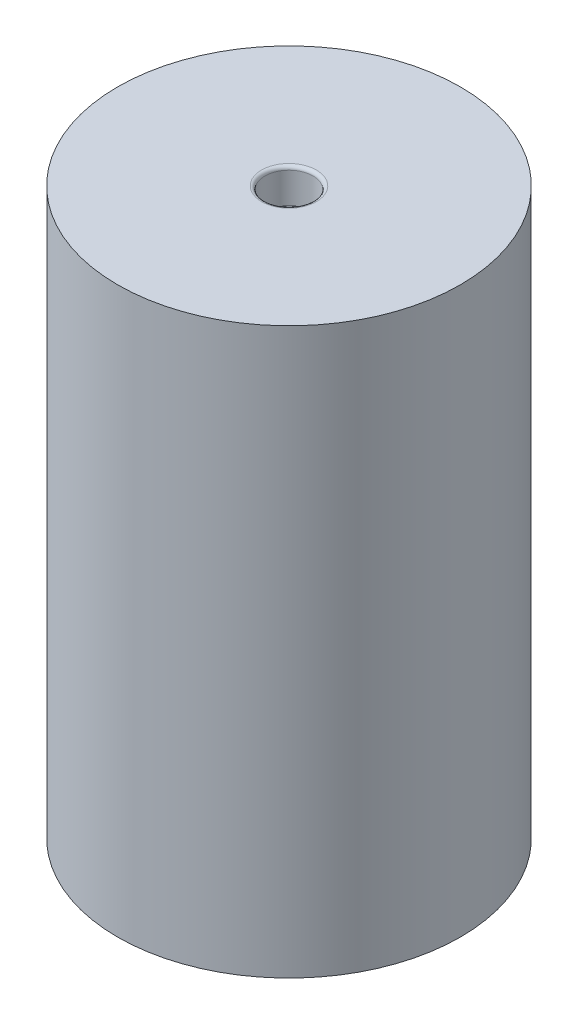
ISO-10303-21;
HEADER;
FILE_DESCRIPTION(('STEP AP214'),'2;1');
FILE_NAME('part.step','',(''),(''),'','','');
FILE_SCHEMA(('AUTOMOTIVE_DESIGN { 1 0 10303 214 1 1 1 1 }'));
ENDSEC;
DATA;
#1=APPLICATION_CONTEXT('core data for automotive mechanical design processes');
#2=APPLICATION_PROTOCOL_DEFINITION('international standard','automotive_design',2000,#1);
#3=PRODUCT_CONTEXT('',#1,'mechanical');
#4=PRODUCT('Part','Part','',(#3));
#5=PRODUCT_RELATED_PRODUCT_CATEGORY('part','',(#4));
#6=PRODUCT_DEFINITION_FORMATION('','',#4);
#7=PRODUCT_DEFINITION_CONTEXT('part definition',#1,'design');
#8=PRODUCT_DEFINITION('design','',#6,#7);
#9=PRODUCT_DEFINITION_SHAPE('','',#8);
#10=(LENGTH_UNIT() NAMED_UNIT(*) SI_UNIT(.MILLI.,.METRE.));
#11=(NAMED_UNIT(*) PLANE_ANGLE_UNIT() SI_UNIT($,.RADIAN.));
#12=(NAMED_UNIT(*) SI_UNIT($,.STERADIAN.) SOLID_ANGLE_UNIT());
#13=UNCERTAINTY_MEASURE_WITH_UNIT(LENGTH_MEASURE(1.E-05),#10,'distance_accuracy_value','');
#14=(GEOMETRIC_REPRESENTATION_CONTEXT(3) GLOBAL_UNCERTAINTY_ASSIGNED_CONTEXT((#13)) GLOBAL_UNIT_ASSIGNED_CONTEXT((#10,
#11,#12)) REPRESENTATION_CONTEXT('',''));
#15=CARTESIAN_POINT('',(0.,0.,0.));
#16=DIRECTION('',(0.,0.,1.));
#17=DIRECTION('',(1.,0.,0.));
#18=AXIS2_PLACEMENT_3D('',#15,#16,#17);
#19=CARTESIAN_POINT('',(0.,82.4,0.));
#20=DIRECTION('',(0.,-1.,0.));
#21=DIRECTION('',(0.,0.,-1.));
#22=AXIS2_PLACEMENT_3D('',#19,#20,#21);
#23=CYLINDRICAL_SURFACE('',#22,25.);
#24=CARTESIAN_POINT('',(0.,82.4,0.));
#25=DIRECTION('',(0.,1.,0.));
#26=DIRECTION('',(0.,0.,1.));
#27=AXIS2_PLACEMENT_3D('',#24,#25,#26);
#28=CIRCLE('',#27,25.);
#29=CARTESIAN_POINT('',(0.,82.4,25.));
#30=VERTEX_POINT('',#29);
#31=EDGE_CURVE('E55',#30,#30,#28,.T.);
#32=ORIENTED_EDGE('',*,*,#31,.F.);
#33=EDGE_LOOP('',(#32));
#34=FACE_BOUND('',#33,.T.);
#35=CARTESIAN_POINT('',(0.,0.,0.));
#36=DIRECTION('',(0.,1.,0.));
#37=DIRECTION('',(0.,0.,1.));
#38=AXIS2_PLACEMENT_3D('',#35,#36,#37);
#39=CIRCLE('',#38,25.);
#40=CARTESIAN_POINT('',(0.,0.,25.));
#41=VERTEX_POINT('',#40);
#42=EDGE_CURVE('E56',#41,#41,#39,.T.);
#43=ORIENTED_EDGE('',*,*,#42,.T.);
#44=EDGE_LOOP('',(#43));
#45=FACE_BOUND('',#44,.T.);
#46=ADVANCED_FACE('F35',(#34,#45),#23,.T.);
#47=CARTESIAN_POINT('',(0.,82.4,0.));
#48=DIRECTION('',(0.,1.,0.));
#49=DIRECTION('',(0.,0.,1.));
#50=AXIS2_PLACEMENT_3D('',#47,#48,#49);
#51=PLANE('',#50);
#52=CARTESIAN_POINT('',(0.,82.4,0.));
#53=DIRECTION('',(0.,1.,0.));
#54=DIRECTION('',(0.,0.,1.));
#55=AXIS2_PLACEMENT_3D('',#52,#53,#54);
#56=CIRCLE('',#55,4.);
#57=CARTESIAN_POINT('',(0.,82.4,4.));
#58=VERTEX_POINT('',#57);
#59=EDGE_CURVE('E46',#58,#58,#56,.F.);
#60=ORIENTED_EDGE('',*,*,#59,.T.);
#61=EDGE_LOOP('',(#60));
#62=FACE_BOUND('',#61,.T.);
#63=ORIENTED_EDGE('',*,*,#31,.T.);
#64=EDGE_LOOP('',(#63));
#65=FACE_BOUND('',#64,.T.);
#66=ADVANCED_FACE('F84',(#62,#65),#51,.T.);
#67=CARTESIAN_POINT('',(0.,0.,0.));
#68=DIRECTION('',(0.,1.,0.));
#69=DIRECTION('',(0.,0.,1.));
#70=AXIS2_PLACEMENT_3D('',#67,#68,#69);
#71=PLANE('',#70);
#72=CARTESIAN_POINT('',(0.,0.,0.));
#73=DIRECTION('',(0.,1.,0.));
#74=DIRECTION('',(0.,0.,1.));
#75=AXIS2_PLACEMENT_3D('',#72,#73,#74);
#76=CIRCLE('',#75,4.);
#77=CARTESIAN_POINT('',(0.,0.,4.));
#78=VERTEX_POINT('',#77);
#79=EDGE_CURVE('E10',#78,#78,#76,.T.);
#80=ORIENTED_EDGE('',*,*,#79,.T.);
#81=EDGE_LOOP('',(#80));
#82=FACE_BOUND('',#81,.T.);
#83=ORIENTED_EDGE('',*,*,#42,.F.);
#84=EDGE_LOOP('',(#83));
#85=FACE_BOUND('',#84,.T.);
#86=ADVANCED_FACE('F90',(#82,#85),#71,.F.);
#87=CARTESIAN_POINT('',(0.,77.4,0.));
#88=DIRECTION('',(0.,1.,0.));
#89=DIRECTION('',(0.,0.,1.));
#90=AXIS2_PLACEMENT_3D('',#87,#88,#89);
#91=CYLINDRICAL_SURFACE('',#90,3.5);
#92=CARTESIAN_POINT('',(0.,81.9,0.));
#93=DIRECTION('',(0.,1.,0.));
#94=DIRECTION('',(0.,0.,1.));
#95=AXIS2_PLACEMENT_3D('',#92,#93,#94);
#96=CIRCLE('',#95,3.5);
#97=CARTESIAN_POINT('',(0.,81.9,3.5));
#98=VERTEX_POINT('',#97);
#99=EDGE_CURVE('E50',#98,#98,#96,.T.);
#100=ORIENTED_EDGE('',*,*,#99,.T.);
#101=EDGE_LOOP('',(#100));
#102=FACE_BOUND('',#101,.T.);
#103=CARTESIAN_POINT('',(0.,77.4,0.));
#104=DIRECTION('',(0.,1.,0.));
#105=DIRECTION('',(0.,0.,1.));
#106=AXIS2_PLACEMENT_3D('',#103,#104,#105);
#107=CIRCLE('',#106,3.5);
#108=CARTESIAN_POINT('',(0.,77.4,3.5));
#109=VERTEX_POINT('',#108);
#110=EDGE_CURVE('E59',#109,#109,#107,.T.);
#111=ORIENTED_EDGE('',*,*,#110,.F.);
#112=EDGE_LOOP('',(#111));
#113=FACE_BOUND('',#112,.T.);
#114=ADVANCED_FACE('F80',(#102,#113),#91,.F.);
#115=CARTESIAN_POINT('',(0.,77.4,0.));
#116=DIRECTION('',(0.,1.,0.));
#117=DIRECTION('',(0.,0.,1.));
#118=AXIS2_PLACEMENT_3D('',#115,#116,#117);
#119=PLANE('',#118);
#120=ORIENTED_EDGE('',*,*,#110,.T.);
#121=EDGE_LOOP('',(#120));
#122=FACE_BOUND('',#121,.T.);
#123=ADVANCED_FACE('F72',(#122),#119,.T.);
#124=CARTESIAN_POINT('',(0.,5.,0.));
#125=DIRECTION('',(0.,-1.,0.));
#126=DIRECTION('',(0.,0.,-1.));
#127=AXIS2_PLACEMENT_3D('',#124,#125,#126);
#128=CYLINDRICAL_SURFACE('',#127,3.5);
#129=CARTESIAN_POINT('',(0.,0.5,0.));
#130=DIRECTION('',(0.,1.,0.));
#131=DIRECTION('',(0.,0.,1.));
#132=AXIS2_PLACEMENT_3D('',#129,#130,#131);
#133=CIRCLE('',#132,3.5);
#134=CARTESIAN_POINT('',(0.,0.5,3.5));
#135=VERTEX_POINT('',#134);
#136=EDGE_CURVE('E42',#135,#135,#133,.F.);
#137=ORIENTED_EDGE('',*,*,#136,.T.);
#138=EDGE_LOOP('',(#137));
#139=FACE_BOUND('',#138,.T.);
#140=CARTESIAN_POINT('',(0.,5.,0.));
#141=DIRECTION('',(0.,-1.,0.));
#142=DIRECTION('',(0.,0.,-1.));
#143=AXIS2_PLACEMENT_3D('',#140,#141,#142);
#144=CIRCLE('',#143,3.5);
#145=CARTESIAN_POINT('',(0.,5.,-3.5));
#146=VERTEX_POINT('',#145);
#147=EDGE_CURVE('E64',#146,#146,#144,.T.);
#148=ORIENTED_EDGE('',*,*,#147,.F.);
#149=EDGE_LOOP('',(#148));
#150=FACE_BOUND('',#149,.T.);
#151=ADVANCED_FACE('F70',(#139,#150),#128,.F.);
#152=CARTESIAN_POINT('',(0.,5.,0.));
#153=DIRECTION('',(0.,-1.,0.));
#154=DIRECTION('',(0.,0.,-1.));
#155=AXIS2_PLACEMENT_3D('',#152,#153,#154);
#156=PLANE('',#155);
#157=ORIENTED_EDGE('',*,*,#147,.T.);
#158=EDGE_LOOP('',(#157));
#159=FACE_BOUND('',#158,.T.);
#160=ADVANCED_FACE('F68',(#159),#156,.T.);
#161=CARTESIAN_POINT('',(0.,81.9,0.));
#162=DIRECTION('',(0.,1.,0.));
#163=DIRECTION('',(0.,0.,1.));
#164=AXIS2_PLACEMENT_3D('',#161,#162,#163);
#165=TOROIDAL_SURFACE('',#164,4.,0.5);
#166=ORIENTED_EDGE('',*,*,#59,.F.);
#167=EDGE_LOOP('',(#166));
#168=FACE_BOUND('',#167,.T.);
#169=ORIENTED_EDGE('',*,*,#99,.F.);
#170=EDGE_LOOP('',(#169));
#171=FACE_BOUND('',#170,.T.);
#172=ADVANCED_FACE('F78',(#168,#171),#165,.T.);
#173=CARTESIAN_POINT('',(0.,0.5,0.));
#174=DIRECTION('',(0.,1.,0.));
#175=DIRECTION('',(0.,0.,1.));
#176=AXIS2_PLACEMENT_3D('',#173,#174,#175);
#177=TOROIDAL_SURFACE('',#176,4.,0.5);
#178=ORIENTED_EDGE('',*,*,#79,.F.);
#179=EDGE_LOOP('',(#178));
#180=FACE_BOUND('',#179,.T.);
#181=ORIENTED_EDGE('',*,*,#136,.F.);
#182=EDGE_LOOP('',(#181));
#183=FACE_BOUND('',#182,.T.);
#184=ADVANCED_FACE('F37',(#180,#183),#177,.T.);
#185=CLOSED_SHELL('',(#46,#66,#86,#114,#123,#151,#160,#172,#184));
#186=MANIFOLD_SOLID_BREP('B2',#185);
#187=ADVANCED_BREP_SHAPE_REPRESENTATION('',(#18,#186),#14);
#188=SHAPE_DEFINITION_REPRESENTATION(#9,#187);
ENDSEC;
END-ISO-10303-21;
